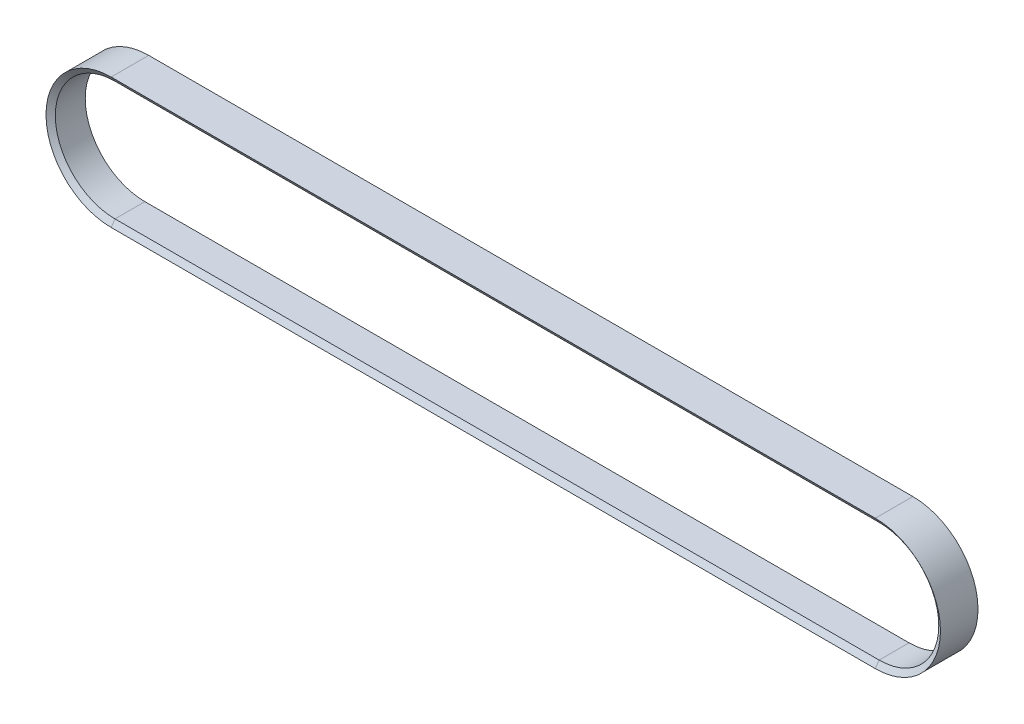
ISO-10303-21;
HEADER;
FILE_DESCRIPTION(('STEP AP214'),'2;1');
FILE_NAME('part.step','',(''),(''),'','','');
FILE_SCHEMA(('AUTOMOTIVE_DESIGN { 1 0 10303 214 1 1 1 1 }'));
ENDSEC;
DATA;
#1=APPLICATION_CONTEXT('core data for automotive mechanical design processes');
#2=APPLICATION_PROTOCOL_DEFINITION('international standard','automotive_design',2000,#1);
#3=PRODUCT_CONTEXT('',#1,'mechanical');
#4=PRODUCT('Part','Part','',(#3));
#5=PRODUCT_RELATED_PRODUCT_CATEGORY('part','',(#4));
#6=PRODUCT_DEFINITION_FORMATION('','',#4);
#7=PRODUCT_DEFINITION_CONTEXT('part definition',#1,'design');
#8=PRODUCT_DEFINITION('design','',#6,#7);
#9=PRODUCT_DEFINITION_SHAPE('','',#8);
#10=(LENGTH_UNIT() NAMED_UNIT(*) SI_UNIT(.MILLI.,.METRE.));
#11=(NAMED_UNIT(*) PLANE_ANGLE_UNIT() SI_UNIT($,.RADIAN.));
#12=(NAMED_UNIT(*) SI_UNIT($,.STERADIAN.) SOLID_ANGLE_UNIT());
#13=UNCERTAINTY_MEASURE_WITH_UNIT(LENGTH_MEASURE(1.E-05),#10,'distance_accuracy_value','');
#14=(GEOMETRIC_REPRESENTATION_CONTEXT(3) GLOBAL_UNCERTAINTY_ASSIGNED_CONTEXT((#13)) GLOBAL_UNIT_ASSIGNED_CONTEXT((#10,
#11,#12)) REPRESENTATION_CONTEXT('',''));
#15=CARTESIAN_POINT('',(0.,0.,0.));
#16=DIRECTION('',(0.,0.,1.));
#17=DIRECTION('',(1.,0.,0.));
#18=AXIS2_PLACEMENT_3D('',#15,#16,#17);
#19=CARTESIAN_POINT('',(0.,0.,0.));
#20=DIRECTION('',(0.,0.,-1.));
#21=DIRECTION('',(-1.,0.,0.));
#22=AXIS2_PLACEMENT_3D('',#19,#20,#21);
#23=CYLINDRICAL_SURFACE('',#22,54.);
#24=CARTESIAN_POINT('',(0.,0.,13.535));
#25=DIRECTION('',(0.,0.,-1.));
#26=DIRECTION('',(0.,-1.,0.));
#27=AXIS2_PLACEMENT_3D('',#24,#25,#26);
#28=CIRCLE('',#27,54.);
#29=CARTESIAN_POINT('',(0.,-54.,13.535));
#30=VERTEX_POINT('',#29);
#31=CARTESIAN_POINT('',(0.,54.,13.535));
#32=VERTEX_POINT('',#31);
#33=EDGE_CURVE('E13',#30,#32,#28,.T.);
#34=ORIENTED_EDGE('',*,*,#33,.F.);
#35=DIRECTION('',(0.,0.,-1.));
#36=VECTOR('',#35,1.);
#37=CARTESIAN_POINT('',(0.,-54.,13.535));
#38=LINE('',#37,#36);
#39=CARTESIAN_POINT('',(0.,-54.,-13.535));
#40=VERTEX_POINT('',#39);
#41=EDGE_CURVE('E56',#30,#40,#38,.T.);
#42=ORIENTED_EDGE('',*,*,#41,.T.);
#43=CARTESIAN_POINT('',(0.,0.,-13.535));
#44=DIRECTION('',(0.,0.,-1.));
#45=DIRECTION('',(0.,-1.,0.));
#46=AXIS2_PLACEMENT_3D('',#43,#44,#45);
#47=CIRCLE('',#46,54.);
#48=CARTESIAN_POINT('',(0.,54.,-13.535));
#49=VERTEX_POINT('',#48);
#50=EDGE_CURVE('E142',#40,#49,#47,.T.);
#51=ORIENTED_EDGE('',*,*,#50,.T.);
#52=DIRECTION('',(0.,0.,-1.));
#53=VECTOR('',#52,1.);
#54=CARTESIAN_POINT('',(0.,54.,13.535));
#55=LINE('',#54,#53);
#56=EDGE_CURVE('E145',#32,#49,#55,.T.);
#57=ORIENTED_EDGE('',*,*,#56,.F.);
#58=EDGE_LOOP('',(#34,#42,#51,#57));
#59=FACE_BOUND('',#58,.T.);
#60=ADVANCED_FACE('F53',(#59),#23,.F.);
#61=CARTESIAN_POINT('',(0.,0.,17.));
#62=DIRECTION('',(0.,0.,1.));
#63=DIRECTION('',(1.,0.,0.));
#64=AXIS2_PLACEMENT_3D('',#61,#62,#63);
#65=CONICAL_SURFACE('',#64,59.,0.964783814806948);
#66=CARTESIAN_POINT('',(0.,0.,17.));
#67=DIRECTION('',(0.,0.,-1.));
#68=DIRECTION('',(0.,-1.,0.));
#69=AXIS2_PLACEMENT_3D('',#66,#67,#68);
#70=CIRCLE('',#69,59.);
#71=CARTESIAN_POINT('',(0.,-59.,17.));
#72=VERTEX_POINT('',#71);
#73=CARTESIAN_POINT('',(0.,59.,17.));
#74=VERTEX_POINT('',#73);
#75=EDGE_CURVE('E62',#72,#74,#70,.T.);
#76=ORIENTED_EDGE('',*,*,#75,.F.);
#77=DIRECTION('',(0.,0.821925797703744,-0.569594577808695));
#78=VECTOR('',#77,1.);
#79=CARTESIAN_POINT('',(0.,-54.,13.535));
#80=LINE('',#79,#78);
#81=EDGE_CURVE('E232',#72,#30,#80,.T.);
#82=ORIENTED_EDGE('',*,*,#81,.T.);
#83=ORIENTED_EDGE('',*,*,#33,.T.);
#84=DIRECTION('',(0.,-0.821925797703744,-0.569594577808695));
#85=VECTOR('',#84,1.);
#86=CARTESIAN_POINT('',(0.,54.,13.535));
#87=LINE('',#86,#85);
#88=EDGE_CURVE('E173',#74,#32,#87,.T.);
#89=ORIENTED_EDGE('',*,*,#88,.F.);
#90=EDGE_LOOP('',(#76,#82,#83,#89));
#91=FACE_BOUND('',#90,.T.);
#92=ADVANCED_FACE('F266',(#91),#65,.F.);
#93=CARTESIAN_POINT('',(0.,0.,0.));
#94=DIRECTION('',(0.,0.,-1.));
#95=DIRECTION('',(-1.,0.,0.));
#96=AXIS2_PLACEMENT_3D('',#93,#94,#95);
#97=CYLINDRICAL_SURFACE('',#96,59.);
#98=CARTESIAN_POINT('',(0.,0.,-17.));
#99=DIRECTION('',(0.,0.,-1.));
#100=DIRECTION('',(0.,-1.,0.));
#101=AXIS2_PLACEMENT_3D('',#98,#99,#100);
#102=CIRCLE('',#101,59.);
#103=CARTESIAN_POINT('',(0.,-59.,-17.));
#104=VERTEX_POINT('',#103);
#105=CARTESIAN_POINT('',(0.,59.,-17.));
#106=VERTEX_POINT('',#105);
#107=EDGE_CURVE('E152',#104,#106,#102,.T.);
#108=ORIENTED_EDGE('',*,*,#107,.F.);
#109=DIRECTION('',(0.,0.,1.));
#110=VECTOR('',#109,1.);
#111=CARTESIAN_POINT('',(0.,-59.,-17.));
#112=LINE('',#111,#110);
#113=EDGE_CURVE('E208',#104,#72,#112,.T.);
#114=ORIENTED_EDGE('',*,*,#113,.T.);
#115=ORIENTED_EDGE('',*,*,#75,.T.);
#116=DIRECTION('',(0.,0.,1.));
#117=VECTOR('',#116,1.);
#118=CARTESIAN_POINT('',(0.,59.,-17.));
#119=LINE('',#118,#117);
#120=EDGE_CURVE('E178',#106,#74,#119,.T.);
#121=ORIENTED_EDGE('',*,*,#120,.F.);
#122=EDGE_LOOP('',(#108,#114,#115,#121));
#123=FACE_BOUND('',#122,.T.);
#124=ADVANCED_FACE('F271',(#123),#97,.T.);
#125=CARTESIAN_POINT('',(692.,-54.,13.535));
#126=DIRECTION('',(0.,1.,0.));
#127=DIRECTION('',(-1.,0.,0.));
#128=AXIS2_PLACEMENT_3D('',#125,#126,#127);
#129=PLANE('',#128);
#130=ORIENTED_EDGE('',*,*,#41,.F.);
#131=DIRECTION('',(-1.,0.,0.));
#132=VECTOR('',#131,1.);
#133=CARTESIAN_POINT('',(692.,-54.,13.535));
#134=LINE('',#133,#132);
#135=CARTESIAN_POINT('',(692.,-54.,13.535));
#136=VERTEX_POINT('',#135);
#137=EDGE_CURVE('E98',#136,#30,#134,.T.);
#138=ORIENTED_EDGE('',*,*,#137,.F.);
#139=DIRECTION('',(0.,0.,-1.));
#140=VECTOR('',#139,1.);
#141=CARTESIAN_POINT('',(692.,-54.,13.535));
#142=LINE('',#141,#140);
#143=CARTESIAN_POINT('',(692.,-54.,-13.535));
#144=VERTEX_POINT('',#143);
#145=EDGE_CURVE('E212',#136,#144,#142,.T.);
#146=ORIENTED_EDGE('',*,*,#145,.T.);
#147=DIRECTION('',(-1.,0.,0.));
#148=VECTOR('',#147,1.);
#149=CARTESIAN_POINT('',(692.,-54.,-13.535));
#150=LINE('',#149,#148);
#151=EDGE_CURVE('E205',#144,#40,#150,.T.);
#152=ORIENTED_EDGE('',*,*,#151,.T.);
#153=EDGE_LOOP('',(#130,#138,#146,#152));
#154=FACE_BOUND('',#153,.T.);
#155=ADVANCED_FACE('F255',(#154),#129,.T.);
#156=CARTESIAN_POINT('',(692.,-54.,13.535));
#157=DIRECTION('',(0.,0.569594577808695,0.821925797703743));
#158=DIRECTION('',(0.,-0.821925797703743,0.569594577808695));
#159=AXIS2_PLACEMENT_3D('',#156,#157,#158);
#160=PLANE('',#159);
#161=ORIENTED_EDGE('',*,*,#137,.T.);
#162=ORIENTED_EDGE('',*,*,#81,.F.);
#163=DIRECTION('',(-1.,0.,0.));
#164=VECTOR('',#163,1.);
#165=CARTESIAN_POINT('',(692.,-59.,17.));
#166=LINE('',#165,#164);
#167=CARTESIAN_POINT('',(692.,-59.,17.));
#168=VERTEX_POINT('',#167);
#169=EDGE_CURVE('E107',#168,#72,#166,.T.);
#170=ORIENTED_EDGE('',*,*,#169,.F.);
#171=DIRECTION('',(0.,0.821925797703744,-0.569594577808695));
#172=VECTOR('',#171,1.);
#173=CARTESIAN_POINT('',(692.,-54.,13.535));
#174=LINE('',#173,#172);
#175=EDGE_CURVE('E226',#168,#136,#174,.T.);
#176=ORIENTED_EDGE('',*,*,#175,.T.);
#177=EDGE_LOOP('',(#161,#162,#170,#176));
#178=FACE_BOUND('',#177,.T.);
#179=ADVANCED_FACE('F265',(#178),#160,.T.);
#180=CARTESIAN_POINT('',(692.,-59.,-17.));
#181=DIRECTION('',(0.,-1.,0.));
#182=DIRECTION('',(1.,0.,0.));
#183=AXIS2_PLACEMENT_3D('',#180,#181,#182);
#184=PLANE('',#183);
#185=ORIENTED_EDGE('',*,*,#169,.T.);
#186=ORIENTED_EDGE('',*,*,#113,.F.);
#187=DIRECTION('',(-1.,0.,0.));
#188=VECTOR('',#187,1.);
#189=CARTESIAN_POINT('',(692.,-59.,-17.));
#190=LINE('',#189,#188);
#191=CARTESIAN_POINT('',(692.,-59.,-17.));
#192=VERTEX_POINT('',#191);
#193=EDGE_CURVE('E115',#192,#104,#190,.T.);
#194=ORIENTED_EDGE('',*,*,#193,.F.);
#195=DIRECTION('',(0.,0.,1.));
#196=VECTOR('',#195,1.);
#197=CARTESIAN_POINT('',(692.,-59.,-17.));
#198=LINE('',#197,#196);
#199=EDGE_CURVE('E197',#192,#168,#198,.T.);
#200=ORIENTED_EDGE('',*,*,#199,.T.);
#201=EDGE_LOOP('',(#185,#186,#194,#200));
#202=FACE_BOUND('',#201,.T.);
#203=ADVANCED_FACE('F272',(#202),#184,.T.);
#204=CARTESIAN_POINT('',(692.,-54.,-13.535));
#205=DIRECTION('',(0.,0.569594577808695,-0.821925797703743));
#206=DIRECTION('',(0.,0.821925797703743,0.569594577808695));
#207=AXIS2_PLACEMENT_3D('',#204,#205,#206);
#208=PLANE('',#207);
#209=ORIENTED_EDGE('',*,*,#193,.T.);
#210=DIRECTION('',(0.,-0.821925797703744,-0.569594577808695));
#211=VECTOR('',#210,1.);
#212=CARTESIAN_POINT('',(0.,-54.,-13.535));
#213=LINE('',#212,#211);
#214=EDGE_CURVE('E202',#40,#104,#213,.T.);
#215=ORIENTED_EDGE('',*,*,#214,.F.);
#216=ORIENTED_EDGE('',*,*,#151,.F.);
#217=DIRECTION('',(0.,-0.821925797703744,-0.569594577808695));
#218=VECTOR('',#217,1.);
#219=CARTESIAN_POINT('',(692.,-54.,-13.535));
#220=LINE('',#219,#218);
#221=EDGE_CURVE('E190',#144,#192,#220,.T.);
#222=ORIENTED_EDGE('',*,*,#221,.T.);
#223=EDGE_LOOP('',(#209,#215,#216,#222));
#224=FACE_BOUND('',#223,.T.);
#225=ADVANCED_FACE('F273',(#224),#208,.T.);
#226=CARTESIAN_POINT('',(692.,0.,0.));
#227=DIRECTION('',(0.,0.,-1.));
#228=DIRECTION('',(-1.,0.,0.));
#229=AXIS2_PLACEMENT_3D('',#226,#227,#228);
#230=CYLINDRICAL_SURFACE('',#229,54.);
#231=ORIENTED_EDGE('',*,*,#145,.F.);
#232=CARTESIAN_POINT('',(692.,0.,13.535));
#233=DIRECTION('',(0.,0.,-1.));
#234=DIRECTION('',(0.,1.,0.));
#235=AXIS2_PLACEMENT_3D('',#232,#233,#234);
#236=CIRCLE('',#235,54.);
#237=CARTESIAN_POINT('',(692.,54.,13.535));
#238=VERTEX_POINT('',#237);
#239=EDGE_CURVE('E243',#238,#136,#236,.T.);
#240=ORIENTED_EDGE('',*,*,#239,.F.);
#241=DIRECTION('',(0.,0.,-1.));
#242=VECTOR('',#241,1.);
#243=CARTESIAN_POINT('',(692.,54.,13.535));
#244=LINE('',#243,#242);
#245=CARTESIAN_POINT('',(692.,54.,-13.535));
#246=VERTEX_POINT('',#245);
#247=EDGE_CURVE('E201',#238,#246,#244,.T.);
#248=ORIENTED_EDGE('',*,*,#247,.T.);
#249=CARTESIAN_POINT('',(692.,0.,-13.535));
#250=DIRECTION('',(0.,0.,-1.));
#251=DIRECTION('',(0.,1.,0.));
#252=AXIS2_PLACEMENT_3D('',#249,#250,#251);
#253=CIRCLE('',#252,54.);
#254=EDGE_CURVE('E194',#246,#144,#253,.T.);
#255=ORIENTED_EDGE('',*,*,#254,.T.);
#256=EDGE_LOOP('',(#231,#240,#248,#255));
#257=FACE_BOUND('',#256,.T.);
#258=ADVANCED_FACE('F260',(#257),#230,.F.);
#259=CARTESIAN_POINT('',(692.,0.,17.));
#260=DIRECTION('',(0.,0.,1.));
#261=DIRECTION('',(1.,0.,0.));
#262=AXIS2_PLACEMENT_3D('',#259,#260,#261);
#263=CONICAL_SURFACE('',#262,59.,0.964783814806948);
#264=ORIENTED_EDGE('',*,*,#239,.T.);
#265=ORIENTED_EDGE('',*,*,#175,.F.);
#266=CARTESIAN_POINT('',(692.,0.,17.));
#267=DIRECTION('',(0.,0.,-1.));
#268=DIRECTION('',(0.,1.,0.));
#269=AXIS2_PLACEMENT_3D('',#266,#267,#268);
#270=CIRCLE('',#269,59.);
#271=CARTESIAN_POINT('',(692.,59.,17.));
#272=VERTEX_POINT('',#271);
#273=EDGE_CURVE('E127',#272,#168,#270,.T.);
#274=ORIENTED_EDGE('',*,*,#273,.F.);
#275=DIRECTION('',(0.,-0.821925797703744,-0.569594577808695));
#276=VECTOR('',#275,1.);
#277=CARTESIAN_POINT('',(692.,54.,13.535));
#278=LINE('',#277,#276);
#279=EDGE_CURVE('E221',#272,#238,#278,.T.);
#280=ORIENTED_EDGE('',*,*,#279,.T.);
#281=EDGE_LOOP('',(#264,#265,#274,#280));
#282=FACE_BOUND('',#281,.T.);
#283=ADVANCED_FACE('F264',(#282),#263,.F.);
#284=CARTESIAN_POINT('',(692.,0.,0.));
#285=DIRECTION('',(0.,0.,-1.));
#286=DIRECTION('',(-1.,0.,0.));
#287=AXIS2_PLACEMENT_3D('',#284,#285,#286);
#288=CYLINDRICAL_SURFACE('',#287,59.);
#289=ORIENTED_EDGE('',*,*,#273,.T.);
#290=ORIENTED_EDGE('',*,*,#199,.F.);
#291=CARTESIAN_POINT('',(692.,0.,-17.));
#292=DIRECTION('',(0.,0.,-1.));
#293=DIRECTION('',(0.,1.,0.));
#294=AXIS2_PLACEMENT_3D('',#291,#292,#293);
#295=CIRCLE('',#294,59.);
#296=CARTESIAN_POINT('',(692.,59.,-17.));
#297=VERTEX_POINT('',#296);
#298=EDGE_CURVE('E133',#297,#192,#295,.T.);
#299=ORIENTED_EDGE('',*,*,#298,.F.);
#300=DIRECTION('',(0.,0.,1.));
#301=VECTOR('',#300,1.);
#302=CARTESIAN_POINT('',(692.,59.,-17.));
#303=LINE('',#302,#301);
#304=EDGE_CURVE('E188',#297,#272,#303,.T.);
#305=ORIENTED_EDGE('',*,*,#304,.T.);
#306=EDGE_LOOP('',(#289,#290,#299,#305));
#307=FACE_BOUND('',#306,.T.);
#308=ADVANCED_FACE('F326',(#307),#288,.T.);
#309=CARTESIAN_POINT('',(692.,0.,-13.535));
#310=DIRECTION('',(0.,0.,-1.));
#311=DIRECTION('',(-1.,0.,0.));
#312=AXIS2_PLACEMENT_3D('',#309,#310,#311);
#313=CONICAL_SURFACE('',#312,54.,0.964783814806948);
#314=ORIENTED_EDGE('',*,*,#298,.T.);
#315=ORIENTED_EDGE('',*,*,#221,.F.);
#316=ORIENTED_EDGE('',*,*,#254,.F.);
#317=DIRECTION('',(0.,0.821925797703744,-0.569594577808695));
#318=VECTOR('',#317,1.);
#319=CARTESIAN_POINT('',(692.,54.,-13.535));
#320=LINE('',#319,#318);
#321=EDGE_CURVE('E163',#246,#297,#320,.T.);
#322=ORIENTED_EDGE('',*,*,#321,.T.);
#323=EDGE_LOOP('',(#314,#315,#316,#322));
#324=FACE_BOUND('',#323,.T.);
#325=ADVANCED_FACE('F258',(#324),#313,.F.);
#326=CARTESIAN_POINT('',(0.,54.,13.535));
#327=DIRECTION('',(0.,-1.,0.));
#328=DIRECTION('',(1.,0.,0.));
#329=AXIS2_PLACEMENT_3D('',#326,#327,#328);
#330=PLANE('',#329);
#331=ORIENTED_EDGE('',*,*,#247,.F.);
#332=DIRECTION('',(1.,0.,0.));
#333=VECTOR('',#332,1.);
#334=CARTESIAN_POINT('',(0.,54.,13.535));
#335=LINE('',#334,#333);
#336=EDGE_CURVE('E171',#32,#238,#335,.T.);
#337=ORIENTED_EDGE('',*,*,#336,.F.);
#338=ORIENTED_EDGE('',*,*,#56,.T.);
#339=DIRECTION('',(1.,0.,0.));
#340=VECTOR('',#339,1.);
#341=CARTESIAN_POINT('',(0.,54.,-13.535));
#342=LINE('',#341,#340);
#343=EDGE_CURVE('E158',#49,#246,#342,.T.);
#344=ORIENTED_EDGE('',*,*,#343,.T.);
#345=EDGE_LOOP('',(#331,#337,#338,#344));
#346=FACE_BOUND('',#345,.T.);
#347=ADVANCED_FACE('F169',(#346),#330,.T.);
#348=CARTESIAN_POINT('',(0.,54.,13.535));
#349=DIRECTION('',(0.,-0.569594577808695,0.821925797703743));
#350=DIRECTION('',(0.,-0.821925797703743,-0.569594577808695));
#351=AXIS2_PLACEMENT_3D('',#348,#349,#350);
#352=PLANE('',#351);
#353=ORIENTED_EDGE('',*,*,#336,.T.);
#354=ORIENTED_EDGE('',*,*,#279,.F.);
#355=DIRECTION('',(1.,0.,0.));
#356=VECTOR('',#355,1.);
#357=CARTESIAN_POINT('',(0.,59.,17.));
#358=LINE('',#357,#356);
#359=EDGE_CURVE('E217',#74,#272,#358,.T.);
#360=ORIENTED_EDGE('',*,*,#359,.F.);
#361=ORIENTED_EDGE('',*,*,#88,.T.);
#362=EDGE_LOOP('',(#353,#354,#360,#361));
#363=FACE_BOUND('',#362,.T.);
#364=ADVANCED_FACE('F262',(#363),#352,.T.);
#365=CARTESIAN_POINT('',(0.,59.,-17.));
#366=DIRECTION('',(0.,1.,0.));
#367=DIRECTION('',(-1.,0.,0.));
#368=AXIS2_PLACEMENT_3D('',#365,#366,#367);
#369=PLANE('',#368);
#370=ORIENTED_EDGE('',*,*,#359,.T.);
#371=ORIENTED_EDGE('',*,*,#304,.F.);
#372=DIRECTION('',(1.,0.,0.));
#373=VECTOR('',#372,1.);
#374=CARTESIAN_POINT('',(0.,59.,-17.));
#375=LINE('',#374,#373);
#376=EDGE_CURVE('E186',#106,#297,#375,.T.);
#377=ORIENTED_EDGE('',*,*,#376,.F.);
#378=ORIENTED_EDGE('',*,*,#120,.T.);
#379=EDGE_LOOP('',(#370,#371,#377,#378));
#380=FACE_BOUND('',#379,.T.);
#381=ADVANCED_FACE('F269',(#380),#369,.T.);
#382=CARTESIAN_POINT('',(0.,54.,-13.535));
#383=DIRECTION('',(0.,-0.569594577808695,-0.821925797703743));
#384=DIRECTION('',(0.,0.821925797703743,-0.569594577808695));
#385=AXIS2_PLACEMENT_3D('',#382,#383,#384);
#386=PLANE('',#385);
#387=ORIENTED_EDGE('',*,*,#376,.T.);
#388=ORIENTED_EDGE('',*,*,#321,.F.);
#389=ORIENTED_EDGE('',*,*,#343,.F.);
#390=DIRECTION('',(0.,0.821925797703744,-0.569594577808695));
#391=VECTOR('',#390,1.);
#392=CARTESIAN_POINT('',(0.,54.,-13.535));
#393=LINE('',#392,#391);
#394=EDGE_CURVE('E161',#49,#106,#393,.T.);
#395=ORIENTED_EDGE('',*,*,#394,.T.);
#396=EDGE_LOOP('',(#387,#388,#389,#395));
#397=FACE_BOUND('',#396,.T.);
#398=ADVANCED_FACE('F160',(#397),#386,.T.);
#399=CARTESIAN_POINT('',(0.,0.,-13.535));
#400=DIRECTION('',(0.,0.,-1.));
#401=DIRECTION('',(-1.,0.,0.));
#402=AXIS2_PLACEMENT_3D('',#399,#400,#401);
#403=CONICAL_SURFACE('',#402,54.,0.964783814806948);
#404=ORIENTED_EDGE('',*,*,#214,.T.);
#405=ORIENTED_EDGE('',*,*,#107,.T.);
#406=ORIENTED_EDGE('',*,*,#394,.F.);
#407=ORIENTED_EDGE('',*,*,#50,.F.);
#408=EDGE_LOOP('',(#404,#405,#406,#407));
#409=FACE_BOUND('',#408,.T.);
#410=ADVANCED_FACE('F175',(#409),#403,.F.);
#411=CLOSED_SHELL('',(#60,#92,#124,#155,#179,#203,#225,#258,#283,#308,#325,#347,#364,#381,#398,#410));
#412=MANIFOLD_SOLID_BREP('B2',#411);
#413=ADVANCED_BREP_SHAPE_REPRESENTATION('',(#18,#412),#14);
#414=SHAPE_DEFINITION_REPRESENTATION(#9,#413);
ENDSEC;
END-ISO-10303-21;
